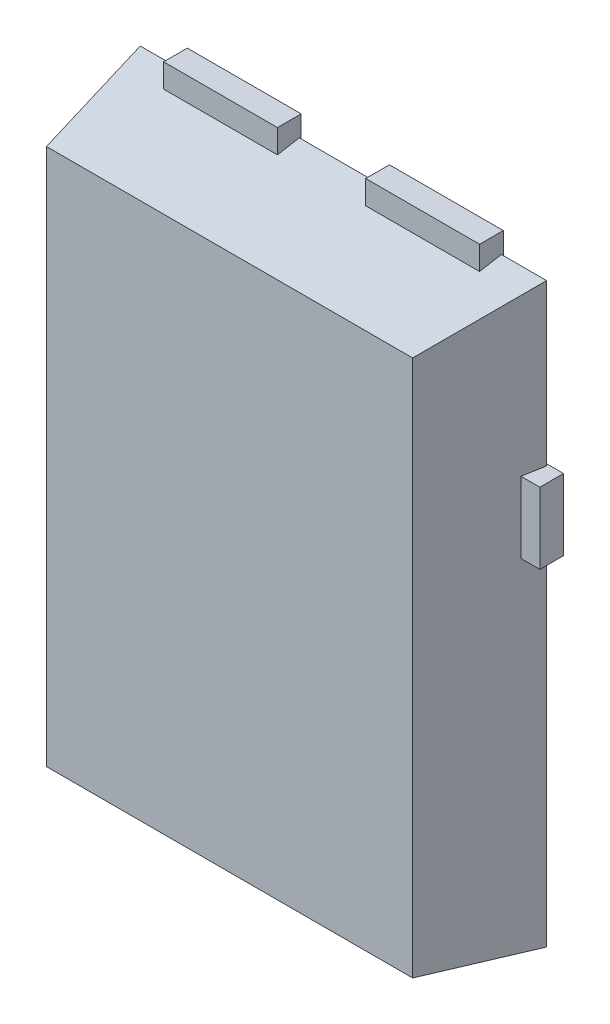
ISO-10303-21;
HEADER;
FILE_DESCRIPTION(('STEP AP214'),'2;1');
FILE_NAME('part.step','',(''),(''),'','','');
FILE_SCHEMA(('AUTOMOTIVE_DESIGN { 1 0 10303 214 1 1 1 1 }'));
ENDSEC;
DATA;
#1=APPLICATION_CONTEXT('core data for automotive mechanical design processes');
#2=APPLICATION_PROTOCOL_DEFINITION('international standard','automotive_design',2000,#1);
#3=PRODUCT_CONTEXT('',#1,'mechanical');
#4=PRODUCT('Part','Part','',(#3));
#5=PRODUCT_RELATED_PRODUCT_CATEGORY('part','',(#4));
#6=PRODUCT_DEFINITION_FORMATION('','',#4);
#7=PRODUCT_DEFINITION_CONTEXT('part definition',#1,'design');
#8=PRODUCT_DEFINITION('design','',#6,#7);
#9=PRODUCT_DEFINITION_SHAPE('','',#8);
#10=(LENGTH_UNIT() NAMED_UNIT(*) SI_UNIT(.MILLI.,.METRE.));
#11=(NAMED_UNIT(*) PLANE_ANGLE_UNIT() SI_UNIT($,.RADIAN.));
#12=(NAMED_UNIT(*) SI_UNIT($,.STERADIAN.) SOLID_ANGLE_UNIT());
#13=UNCERTAINTY_MEASURE_WITH_UNIT(LENGTH_MEASURE(1.E-05),#10,'distance_accuracy_value','');
#14=(GEOMETRIC_REPRESENTATION_CONTEXT(3) GLOBAL_UNCERTAINTY_ASSIGNED_CONTEXT((#13)) GLOBAL_UNIT_ASSIGNED_CONTEXT((#10,
#11,#12)) REPRESENTATION_CONTEXT('',''));
#15=CARTESIAN_POINT('',(0.,0.,0.));
#16=DIRECTION('',(0.,0.,1.));
#17=DIRECTION('',(1.,0.,0.));
#18=AXIS2_PLACEMENT_3D('',#15,#16,#17);
#19=CARTESIAN_POINT('',(0.465,3.25,0.25));
#20=DIRECTION('',(1.,0.,0.));
#21=DIRECTION('',(0.,1.,0.));
#22=AXIS2_PLACEMENT_3D('',#19,#20,#21);
#23=PLANE('',#22);
#24=DIRECTION('',(0.,-1.,0.));
#25=VECTOR('',#24,1.);
#26=CARTESIAN_POINT('',(0.465,3.25,0.));
#27=LINE('',#26,#25);
#28=CARTESIAN_POINT('',(0.465,3.25,0.));
#29=VERTEX_POINT('',#28);
#30=CARTESIAN_POINT('',(0.464999999999999,2.16,0.));
#31=VERTEX_POINT('',#30);
#32=EDGE_CURVE('E109',#29,#31,#27,.T.);
#33=ORIENTED_EDGE('',*,*,#32,.T.);
#34=DIRECTION('',(0.,0.,-1.));
#35=VECTOR('',#34,1.);
#36=CARTESIAN_POINT('',(0.464999999999999,2.16,0.25));
#37=LINE('',#36,#35);
#38=CARTESIAN_POINT('',(0.464999999999999,2.16,0.25));
#39=VERTEX_POINT('',#38);
#40=EDGE_CURVE('E12',#39,#31,#37,.T.);
#41=ORIENTED_EDGE('',*,*,#40,.F.);
#42=DIRECTION('',(0.,-1.,0.));
#43=VECTOR('',#42,1.);
#44=CARTESIAN_POINT('',(0.465,3.25,0.25));
#45=LINE('',#44,#43);
#46=CARTESIAN_POINT('',(0.465,3.25,0.25));
#47=VERTEX_POINT('',#46);
#48=EDGE_CURVE('E97',#47,#39,#45,.T.);
#49=ORIENTED_EDGE('',*,*,#48,.F.);
#50=DIRECTION('',(0.,0.,-1.));
#51=VECTOR('',#50,1.);
#52=CARTESIAN_POINT('',(0.465,3.25,0.25));
#53=LINE('',#52,#51);
#54=EDGE_CURVE('E105',#47,#29,#53,.T.);
#55=ORIENTED_EDGE('',*,*,#54,.T.);
#56=EDGE_LOOP('',(#33,#41,#49,#55));
#57=FACE_BOUND('',#56,.T.);
#58=ADVANCED_FACE('F46',(#57),#23,.F.);
#59=CARTESIAN_POINT('',(0.464999999999999,2.16,0.25));
#60=DIRECTION('',(0.,1.,0.));
#61=DIRECTION('',(-1.,0.,0.));
#62=AXIS2_PLACEMENT_3D('',#59,#60,#61);
#63=PLANE('',#62);
#64=DIRECTION('',(1.,0.,0.));
#65=VECTOR('',#64,1.);
#66=CARTESIAN_POINT('',(0.464999999999999,2.16,0.));
#67=LINE('',#66,#65);
#68=CARTESIAN_POINT('',(1.665,2.16,0.));
#69=VERTEX_POINT('',#68);
#70=EDGE_CURVE('E101',#31,#69,#67,.T.);
#71=ORIENTED_EDGE('',*,*,#70,.T.);
#72=DIRECTION('',(0.,0.,-1.));
#73=VECTOR('',#72,1.);
#74=CARTESIAN_POINT('',(1.665,2.16,0.25));
#75=LINE('',#74,#73);
#76=CARTESIAN_POINT('',(1.665,2.16,0.25));
#77=VERTEX_POINT('',#76);
#78=EDGE_CURVE('E54',#77,#69,#75,.T.);
#79=ORIENTED_EDGE('',*,*,#78,.F.);
#80=DIRECTION('',(1.,0.,0.));
#81=VECTOR('',#80,1.);
#82=CARTESIAN_POINT('',(0.464999999999999,2.16,0.25));
#83=LINE('',#82,#81);
#84=EDGE_CURVE('E92',#39,#77,#83,.T.);
#85=ORIENTED_EDGE('',*,*,#84,.F.);
#86=ORIENTED_EDGE('',*,*,#40,.T.);
#87=EDGE_LOOP('',(#71,#79,#85,#86));
#88=FACE_BOUND('',#87,.T.);
#89=ADVANCED_FACE('F100',(#88),#63,.F.);
#90=CARTESIAN_POINT('',(1.665,3.25,0.25));
#91=DIRECTION('',(-1.,0.,0.));
#92=DIRECTION('',(0.,0.,1.));
#93=AXIS2_PLACEMENT_3D('',#90,#91,#92);
#94=PLANE('',#93);
#95=DIRECTION('',(0.,1.,0.));
#96=VECTOR('',#95,1.);
#97=CARTESIAN_POINT('',(1.665,3.25,0.));
#98=LINE('',#97,#96);
#99=CARTESIAN_POINT('',(1.665,3.25,0.));
#100=VERTEX_POINT('',#99);
#101=EDGE_CURVE('E79',#69,#100,#98,.T.);
#102=ORIENTED_EDGE('',*,*,#101,.T.);
#103=DIRECTION('',(0.,0.,-1.));
#104=VECTOR('',#103,1.);
#105=CARTESIAN_POINT('',(1.665,3.25,0.25));
#106=LINE('',#105,#104);
#107=CARTESIAN_POINT('',(1.665,3.25,0.25));
#108=VERTEX_POINT('',#107);
#109=EDGE_CURVE('E102',#108,#100,#106,.T.);
#110=ORIENTED_EDGE('',*,*,#109,.F.);
#111=DIRECTION('',(0.,1.,0.));
#112=VECTOR('',#111,1.);
#113=CARTESIAN_POINT('',(1.665,3.25,0.25));
#114=LINE('',#113,#112);
#115=EDGE_CURVE('E95',#77,#108,#114,.T.);
#116=ORIENTED_EDGE('',*,*,#115,.F.);
#117=ORIENTED_EDGE('',*,*,#78,.T.);
#118=EDGE_LOOP('',(#102,#110,#116,#117));
#119=FACE_BOUND('',#118,.T.);
#120=ADVANCED_FACE('F103',(#119),#94,.F.);
#121=CARTESIAN_POINT('',(0.465,3.25,0.25));
#122=DIRECTION('',(0.,-1.,0.));
#123=DIRECTION('',(1.,0.,0.));
#124=AXIS2_PLACEMENT_3D('',#121,#122,#123);
#125=PLANE('',#124);
#126=DIRECTION('',(-1.,0.,0.));
#127=VECTOR('',#126,1.);
#128=CARTESIAN_POINT('',(0.465,3.25,0.));
#129=LINE('',#128,#127);
#130=EDGE_CURVE('E85',#100,#29,#129,.T.);
#131=ORIENTED_EDGE('',*,*,#130,.T.);
#132=ORIENTED_EDGE('',*,*,#54,.F.);
#133=DIRECTION('',(-1.,0.,0.));
#134=VECTOR('',#133,1.);
#135=CARTESIAN_POINT('',(0.465,3.25,0.25));
#136=LINE('',#135,#134);
#137=EDGE_CURVE('E62',#108,#47,#136,.T.);
#138=ORIENTED_EDGE('',*,*,#137,.F.);
#139=ORIENTED_EDGE('',*,*,#109,.T.);
#140=EDGE_LOOP('',(#131,#132,#138,#139));
#141=FACE_BOUND('',#140,.T.);
#142=ADVANCED_FACE('F116',(#141),#125,.F.);
#143=CARTESIAN_POINT('',(0.,0.,0.25));
#144=DIRECTION('',(0.,0.,1.));
#145=DIRECTION('',(1.,0.,0.));
#146=AXIS2_PLACEMENT_3D('',#143,#144,#145);
#147=PLANE('',#146);
#148=ORIENTED_EDGE('',*,*,#48,.T.);
#149=ORIENTED_EDGE('',*,*,#84,.T.);
#150=ORIENTED_EDGE('',*,*,#115,.T.);
#151=ORIENTED_EDGE('',*,*,#137,.T.);
#152=EDGE_LOOP('',(#148,#149,#150,#151));
#153=FACE_BOUND('',#152,.T.);
#154=ADVANCED_FACE('F93',(#153),#147,.T.);
#155=CARTESIAN_POINT('',(0.,0.,0.));
#156=DIRECTION('',(0.,0.,1.));
#157=DIRECTION('',(1.,0.,0.));
#158=AXIS2_PLACEMENT_3D('',#155,#156,#157);
#159=PLANE('',#158);
#160=ORIENTED_EDGE('',*,*,#32,.F.);
#161=ORIENTED_EDGE('',*,*,#130,.F.);
#162=ORIENTED_EDGE('',*,*,#101,.F.);
#163=ORIENTED_EDGE('',*,*,#70,.F.);
#164=EDGE_LOOP('',(#160,#161,#162,#163));
#165=FACE_BOUND('',#164,.T.);
#166=ADVANCED_FACE('F119',(#165),#159,.F.);
#167=CLOSED_SHELL('',(#58,#89,#120,#142,#154,#166));
#168=MANIFOLD_SOLID_BREP('B2',#167);
#169=CARTESIAN_POINT('',(-1.665,3.25,0.25));
#170=DIRECTION('',(1.,0.,0.));
#171=DIRECTION('',(0.,0.,-1.));
#172=AXIS2_PLACEMENT_3D('',#169,#170,#171);
#173=PLANE('',#172);
#174=DIRECTION('',(0.,-1.,0.));
#175=VECTOR('',#174,1.);
#176=CARTESIAN_POINT('',(-1.665,3.25,0.));
#177=LINE('',#176,#175);
#178=CARTESIAN_POINT('',(-1.665,3.25,0.));
#179=VERTEX_POINT('',#178);
#180=CARTESIAN_POINT('',(-1.665,2.16,0.));
#181=VERTEX_POINT('',#180);
#182=EDGE_CURVE('E242',#179,#181,#177,.T.);
#183=ORIENTED_EDGE('',*,*,#182,.T.);
#184=DIRECTION('',(0.,0.,-1.));
#185=VECTOR('',#184,1.);
#186=CARTESIAN_POINT('',(-1.665,2.16,0.25));
#187=LINE('',#186,#185);
#188=CARTESIAN_POINT('',(-1.665,2.16,0.25));
#189=VERTEX_POINT('',#188);
#190=EDGE_CURVE('E44',#189,#181,#187,.T.);
#191=ORIENTED_EDGE('',*,*,#190,.F.);
#192=DIRECTION('',(0.,-1.,0.));
#193=VECTOR('',#192,1.);
#194=CARTESIAN_POINT('',(-1.665,3.25,0.25));
#195=LINE('',#194,#193);
#196=CARTESIAN_POINT('',(-1.665,3.25,0.25));
#197=VERTEX_POINT('',#196);
#198=EDGE_CURVE('E230',#197,#189,#195,.T.);
#199=ORIENTED_EDGE('',*,*,#198,.F.);
#200=DIRECTION('',(0.,0.,-1.));
#201=VECTOR('',#200,1.);
#202=CARTESIAN_POINT('',(-1.665,3.25,0.25));
#203=LINE('',#202,#201);
#204=EDGE_CURVE('E238',#197,#179,#203,.T.);
#205=ORIENTED_EDGE('',*,*,#204,.T.);
#206=EDGE_LOOP('',(#183,#191,#199,#205));
#207=FACE_BOUND('',#206,.T.);
#208=ADVANCED_FACE('F179',(#207),#173,.F.);
#209=CARTESIAN_POINT('',(-1.665,2.16,0.25));
#210=DIRECTION('',(0.,1.,0.));
#211=DIRECTION('',(-1.,0.,0.));
#212=AXIS2_PLACEMENT_3D('',#209,#210,#211);
#213=PLANE('',#212);
#214=DIRECTION('',(1.,0.,0.));
#215=VECTOR('',#214,1.);
#216=CARTESIAN_POINT('',(-1.665,2.16,0.));
#217=LINE('',#216,#215);
#218=CARTESIAN_POINT('',(-0.464999999999999,2.16,0.));
#219=VERTEX_POINT('',#218);
#220=EDGE_CURVE('E234',#181,#219,#217,.T.);
#221=ORIENTED_EDGE('',*,*,#220,.T.);
#222=DIRECTION('',(0.,0.,-1.));
#223=VECTOR('',#222,1.);
#224=CARTESIAN_POINT('',(-0.464999999999999,2.16,0.25));
#225=LINE('',#224,#223);
#226=CARTESIAN_POINT('',(-0.464999999999999,2.16,0.25));
#227=VERTEX_POINT('',#226);
#228=EDGE_CURVE('E187',#227,#219,#225,.T.);
#229=ORIENTED_EDGE('',*,*,#228,.F.);
#230=DIRECTION('',(1.,0.,0.));
#231=VECTOR('',#230,1.);
#232=CARTESIAN_POINT('',(-1.665,2.16,0.25));
#233=LINE('',#232,#231);
#234=EDGE_CURVE('E225',#189,#227,#233,.T.);
#235=ORIENTED_EDGE('',*,*,#234,.F.);
#236=ORIENTED_EDGE('',*,*,#190,.T.);
#237=EDGE_LOOP('',(#221,#229,#235,#236));
#238=FACE_BOUND('',#237,.T.);
#239=ADVANCED_FACE('F233',(#238),#213,.F.);
#240=CARTESIAN_POINT('',(-0.465,3.25,0.25));
#241=DIRECTION('',(-1.,0.,0.));
#242=DIRECTION('',(0.,-1.,0.));
#243=AXIS2_PLACEMENT_3D('',#240,#241,#242);
#244=PLANE('',#243);
#245=DIRECTION('',(0.,1.,0.));
#246=VECTOR('',#245,1.);
#247=CARTESIAN_POINT('',(-0.465,3.25,0.));
#248=LINE('',#247,#246);
#249=CARTESIAN_POINT('',(-0.465,3.25,0.));
#250=VERTEX_POINT('',#249);
#251=EDGE_CURVE('E212',#219,#250,#248,.T.);
#252=ORIENTED_EDGE('',*,*,#251,.T.);
#253=DIRECTION('',(0.,0.,-1.));
#254=VECTOR('',#253,1.);
#255=CARTESIAN_POINT('',(-0.465,3.25,0.25));
#256=LINE('',#255,#254);
#257=CARTESIAN_POINT('',(-0.465,3.25,0.25));
#258=VERTEX_POINT('',#257);
#259=EDGE_CURVE('E235',#258,#250,#256,.T.);
#260=ORIENTED_EDGE('',*,*,#259,.F.);
#261=DIRECTION('',(0.,1.,0.));
#262=VECTOR('',#261,1.);
#263=CARTESIAN_POINT('',(-0.465,3.25,0.25));
#264=LINE('',#263,#262);
#265=EDGE_CURVE('E228',#227,#258,#264,.T.);
#266=ORIENTED_EDGE('',*,*,#265,.F.);
#267=ORIENTED_EDGE('',*,*,#228,.T.);
#268=EDGE_LOOP('',(#252,#260,#266,#267));
#269=FACE_BOUND('',#268,.T.);
#270=ADVANCED_FACE('F236',(#269),#244,.F.);
#271=CARTESIAN_POINT('',(-1.665,3.25,0.25));
#272=DIRECTION('',(0.,-1.,0.));
#273=DIRECTION('',(1.,0.,0.));
#274=AXIS2_PLACEMENT_3D('',#271,#272,#273);
#275=PLANE('',#274);
#276=DIRECTION('',(-1.,0.,0.));
#277=VECTOR('',#276,1.);
#278=CARTESIAN_POINT('',(-1.665,3.25,0.));
#279=LINE('',#278,#277);
#280=EDGE_CURVE('E218',#250,#179,#279,.T.);
#281=ORIENTED_EDGE('',*,*,#280,.T.);
#282=ORIENTED_EDGE('',*,*,#204,.F.);
#283=DIRECTION('',(-1.,0.,0.));
#284=VECTOR('',#283,1.);
#285=CARTESIAN_POINT('',(-1.665,3.25,0.25));
#286=LINE('',#285,#284);
#287=EDGE_CURVE('E195',#258,#197,#286,.T.);
#288=ORIENTED_EDGE('',*,*,#287,.F.);
#289=ORIENTED_EDGE('',*,*,#259,.T.);
#290=EDGE_LOOP('',(#281,#282,#288,#289));
#291=FACE_BOUND('',#290,.T.);
#292=ADVANCED_FACE('F249',(#291),#275,.F.);
#293=CARTESIAN_POINT('',(0.,0.,0.25));
#294=DIRECTION('',(0.,0.,1.));
#295=DIRECTION('',(1.,0.,0.));
#296=AXIS2_PLACEMENT_3D('',#293,#294,#295);
#297=PLANE('',#296);
#298=ORIENTED_EDGE('',*,*,#198,.T.);
#299=ORIENTED_EDGE('',*,*,#234,.T.);
#300=ORIENTED_EDGE('',*,*,#265,.T.);
#301=ORIENTED_EDGE('',*,*,#287,.T.);
#302=EDGE_LOOP('',(#298,#299,#300,#301));
#303=FACE_BOUND('',#302,.T.);
#304=ADVANCED_FACE('F226',(#303),#297,.T.);
#305=CARTESIAN_POINT('',(0.,0.,0.));
#306=DIRECTION('',(0.,0.,1.));
#307=DIRECTION('',(1.,0.,0.));
#308=AXIS2_PLACEMENT_3D('',#305,#306,#307);
#309=PLANE('',#308);
#310=ORIENTED_EDGE('',*,*,#182,.F.);
#311=ORIENTED_EDGE('',*,*,#280,.F.);
#312=ORIENTED_EDGE('',*,*,#251,.F.);
#313=ORIENTED_EDGE('',*,*,#220,.F.);
#314=EDGE_LOOP('',(#310,#311,#312,#313));
#315=FACE_BOUND('',#314,.T.);
#316=ADVANCED_FACE('F252',(#315),#309,.F.);
#317=CLOSED_SHELL('',(#208,#239,#270,#292,#304,#316));
#318=MANIFOLD_SOLID_BREP('B6',#317);
#319=CARTESIAN_POINT('',(-1.775,-2.59,0.25));
#320=DIRECTION('',(0.,1.,0.));
#321=DIRECTION('',(0.,0.,1.));
#322=AXIS2_PLACEMENT_3D('',#319,#320,#321);
#323=PLANE('',#322);
#324=DIRECTION('',(1.,0.,0.));
#325=VECTOR('',#324,1.);
#326=CARTESIAN_POINT('',(-1.775,-2.59,0.02));
#327=LINE('',#326,#325);
#328=CARTESIAN_POINT('',(-1.775,-2.59,0.02));
#329=VERTEX_POINT('',#328);
#330=CARTESIAN_POINT('',(-1.025,-2.59,0.02));
#331=VERTEX_POINT('',#330);
#332=EDGE_CURVE('E687',#329,#331,#327,.T.);
#333=ORIENTED_EDGE('',*,*,#332,.F.);
#334=DIRECTION('',(0.,0.,-1.));
#335=VECTOR('',#334,1.);
#336=CARTESIAN_POINT('',(-1.775,-2.59,0.25));
#337=LINE('',#336,#335);
#338=CARTESIAN_POINT('',(-1.775,-2.59,0.));
#339=VERTEX_POINT('',#338);
#340=EDGE_CURVE('E489',#329,#339,#337,.T.);
#341=ORIENTED_EDGE('',*,*,#340,.T.);
#342=DIRECTION('',(1.,0.,0.));
#343=VECTOR('',#342,1.);
#344=CARTESIAN_POINT('',(-1.775,-2.59,0.));
#345=LINE('',#344,#343);
#346=CARTESIAN_POINT('',(-1.025,-2.59,0.));
#347=VERTEX_POINT('',#346);
#348=EDGE_CURVE('E490',#339,#347,#345,.T.);
#349=ORIENTED_EDGE('',*,*,#348,.T.);
#350=DIRECTION('',(0.,0.,-1.));
#351=VECTOR('',#350,1.);
#352=CARTESIAN_POINT('',(-1.025,-2.59,0.25));
#353=LINE('',#352,#351);
#354=EDGE_CURVE('E469',#331,#347,#353,.T.);
#355=ORIENTED_EDGE('',*,*,#354,.F.);
#356=EDGE_LOOP('',(#333,#341,#349,#355));
#357=FACE_BOUND('',#356,.T.);
#358=ADVANCED_FACE('F303',(#357),#323,.F.);
#359=CARTESIAN_POINT('',(-1.025,-2.59,0.25));
#360=DIRECTION('',(1.,0.,0.));
#361=DIRECTION('',(0.,0.,-1.));
#362=AXIS2_PLACEMENT_3D('',#359,#360,#361);
#363=PLANE('',#362);
#364=DIRECTION('',(0.,-1.,0.));
#365=VECTOR('',#364,1.);
#366=CARTESIAN_POINT('',(-1.025,-2.59,0.25));
#367=LINE('',#366,#365);
#368=CARTESIAN_POINT('',(-1.025,-3.00062844540163,0.25));
#369=VERTEX_POINT('',#368);
#370=CARTESIAN_POINT('',(-1.025,-3.25,0.25));
#371=VERTEX_POINT('',#370);
#372=EDGE_CURVE('E450',#369,#371,#367,.T.);
#373=ORIENTED_EDGE('',*,*,#372,.F.);
#374=DIRECTION('',(0.,-0.173648177666937,-0.984807753012207));
#375=VECTOR('',#374,1.);
#376=CARTESIAN_POINT('',(-1.025,-2.98824648271516,0.320221599874933));
#377=LINE('',#376,#375);
#378=CARTESIAN_POINT('',(-1.025,-3.04118365096458,0.02));
#379=VERTEX_POINT('',#378);
#380=EDGE_CURVE('E557',#369,#379,#377,.T.);
#381=ORIENTED_EDGE('',*,*,#380,.T.);
#382=DIRECTION('',(0.,-1.,0.));
#383=VECTOR('',#382,1.);
#384=CARTESIAN_POINT('',(-1.025,-2.59,0.02));
#385=LINE('',#384,#383);
#386=EDGE_CURVE('E618',#331,#379,#385,.T.);
#387=ORIENTED_EDGE('',*,*,#386,.F.);
#388=ORIENTED_EDGE('',*,*,#354,.T.);
#389=DIRECTION('',(0.,-1.,0.));
#390=VECTOR('',#389,1.);
#391=CARTESIAN_POINT('',(-1.025,-2.59,0.));
#392=LINE('',#391,#390);
#393=CARTESIAN_POINT('',(-1.025,-3.25,0.));
#394=VERTEX_POINT('',#393);
#395=EDGE_CURVE('E466',#347,#394,#392,.T.);
#396=ORIENTED_EDGE('',*,*,#395,.T.);
#397=DIRECTION('',(0.,0.,-1.));
#398=VECTOR('',#397,1.);
#399=CARTESIAN_POINT('',(-1.025,-3.25,0.25));
#400=LINE('',#399,#398);
#401=EDGE_CURVE('E463',#371,#394,#400,.T.);
#402=ORIENTED_EDGE('',*,*,#401,.F.);
#403=EDGE_LOOP('',(#373,#381,#387,#388,#396,#402));
#404=FACE_BOUND('',#403,.T.);
#405=ADVANCED_FACE('F464',(#404),#363,.F.);
#406=CARTESIAN_POINT('',(1.025,-3.25,0.25));
#407=DIRECTION('',(-1.,0.,0.));
#408=DIRECTION('',(0.,0.,1.));
#409=AXIS2_PLACEMENT_3D('',#406,#407,#408);
#410=PLANE('',#409);
#411=DIRECTION('',(0.,1.,0.));
#412=VECTOR('',#411,1.);
#413=CARTESIAN_POINT('',(1.025,-3.25,0.02));
#414=LINE('',#413,#412);
#415=CARTESIAN_POINT('',(1.025,-3.04118365096458,0.02));
#416=VERTEX_POINT('',#415);
#417=CARTESIAN_POINT('',(1.025,-2.59,0.02));
#418=VERTEX_POINT('',#417);
#419=EDGE_CURVE('E493',#416,#418,#414,.T.);
#420=ORIENTED_EDGE('',*,*,#419,.F.);
#421=DIRECTION('',(0.,0.173648177666937,0.984807753012207));
#422=VECTOR('',#421,1.);
#423=CARTESIAN_POINT('',(1.025,-3.00814791785581,0.207354952577458));
#424=LINE('',#423,#422);
#425=CARTESIAN_POINT('',(1.025,-3.00062844540163,0.25));
#426=VERTEX_POINT('',#425);
#427=EDGE_CURVE('E553',#416,#426,#424,.T.);
#428=ORIENTED_EDGE('',*,*,#427,.T.);
#429=DIRECTION('',(0.,1.,0.));
#430=VECTOR('',#429,1.);
#431=CARTESIAN_POINT('',(1.025,-3.25,0.25));
#432=LINE('',#431,#430);
#433=CARTESIAN_POINT('',(1.025,-3.25,0.25));
#434=VERTEX_POINT('',#433);
#435=EDGE_CURVE('E475',#434,#426,#432,.T.);
#436=ORIENTED_EDGE('',*,*,#435,.F.);
#437=DIRECTION('',(0.,0.,-1.));
#438=VECTOR('',#437,1.);
#439=CARTESIAN_POINT('',(1.025,-3.25,0.25));
#440=LINE('',#439,#438);
#441=CARTESIAN_POINT('',(1.025,-3.25,0.));
#442=VERTEX_POINT('',#441);
#443=EDGE_CURVE('E470',#434,#442,#440,.T.);
#444=ORIENTED_EDGE('',*,*,#443,.T.);
#445=DIRECTION('',(0.,1.,0.));
#446=VECTOR('',#445,1.);
#447=CARTESIAN_POINT('',(1.025,-3.25,0.));
#448=LINE('',#447,#446);
#449=CARTESIAN_POINT('',(1.025,-2.59,0.));
#450=VERTEX_POINT('',#449);
#451=EDGE_CURVE('E497',#442,#450,#448,.T.);
#452=ORIENTED_EDGE('',*,*,#451,.T.);
#453=DIRECTION('',(0.,0.,-1.));
#454=VECTOR('',#453,1.);
#455=CARTESIAN_POINT('',(1.025,-2.59,0.25));
#456=LINE('',#455,#454);
#457=EDGE_CURVE('E538',#418,#450,#456,.T.);
#458=ORIENTED_EDGE('',*,*,#457,.F.);
#459=EDGE_LOOP('',(#420,#428,#436,#444,#452,#458));
#460=FACE_BOUND('',#459,.T.);
#461=ADVANCED_FACE('F630',(#460),#410,.F.);
#462=CARTESIAN_POINT('',(1.025,-2.59,0.25));
#463=DIRECTION('',(0.,1.,0.));
#464=DIRECTION('',(0.,0.,1.));
#465=AXIS2_PLACEMENT_3D('',#462,#463,#464);
#466=PLANE('',#465);
#467=DIRECTION('',(1.,0.,0.));
#468=VECTOR('',#467,1.);
#469=CARTESIAN_POINT('',(1.025,-2.59,0.02));
#470=LINE('',#469,#468);
#471=CARTESIAN_POINT('',(1.775,-2.59,0.02));
#472=VERTEX_POINT('',#471);
#473=EDGE_CURVE('E615',#418,#472,#470,.T.);
#474=ORIENTED_EDGE('',*,*,#473,.F.);
#475=ORIENTED_EDGE('',*,*,#457,.T.);
#476=DIRECTION('',(1.,0.,0.));
#477=VECTOR('',#476,1.);
#478=CARTESIAN_POINT('',(1.025,-2.59,0.));
#479=LINE('',#478,#477);
#480=CARTESIAN_POINT('',(1.775,-2.59,0.));
#481=VERTEX_POINT('',#480);
#482=EDGE_CURVE('E500',#450,#481,#479,.T.);
#483=ORIENTED_EDGE('',*,*,#482,.T.);
#484=DIRECTION('',(0.,0.,-1.));
#485=VECTOR('',#484,1.);
#486=CARTESIAN_POINT('',(1.775,-2.59,0.25));
#487=LINE('',#486,#485);
#488=EDGE_CURVE('E536',#472,#481,#487,.T.);
#489=ORIENTED_EDGE('',*,*,#488,.F.);
#490=EDGE_LOOP('',(#474,#475,#483,#489));
#491=FACE_BOUND('',#490,.T.);
#492=ADVANCED_FACE('F629',(#491),#466,.F.);
#493=CARTESIAN_POINT('',(1.775,-2.59,0.25));
#494=DIRECTION('',(-1.,0.,0.));
#495=DIRECTION('',(0.,0.,1.));
#496=AXIS2_PLACEMENT_3D('',#493,#494,#495);
#497=PLANE('',#496);
#498=DIRECTION('',(0.,1.,0.));
#499=VECTOR('',#498,1.);
#500=CARTESIAN_POINT('',(1.775,-2.59,0.02));
#501=LINE('',#500,#499);
#502=CARTESIAN_POINT('',(1.775,0.6,0.02));
#503=VERTEX_POINT('',#502);
#504=EDGE_CURVE('E612',#472,#503,#501,.T.);
#505=ORIENTED_EDGE('',*,*,#504,.F.);
#506=ORIENTED_EDGE('',*,*,#488,.T.);
#507=DIRECTION('',(0.,1.,0.));
#508=VECTOR('',#507,1.);
#509=CARTESIAN_POINT('',(1.775,-2.59,0.));
#510=LINE('',#509,#508);
#511=CARTESIAN_POINT('',(1.775,0.6,0.));
#512=VERTEX_POINT('',#511);
#513=EDGE_CURVE('E503',#481,#512,#510,.T.);
#514=ORIENTED_EDGE('',*,*,#513,.T.);
#515=DIRECTION('',(0.,0.,-1.));
#516=VECTOR('',#515,1.);
#517=CARTESIAN_POINT('',(1.775,0.6,0.25));
#518=LINE('',#517,#516);
#519=EDGE_CURVE('E534',#503,#512,#518,.T.);
#520=ORIENTED_EDGE('',*,*,#519,.F.);
#521=EDGE_LOOP('',(#505,#506,#514,#520));
#522=FACE_BOUND('',#521,.T.);
#523=ADVANCED_FACE('F640',(#522),#497,.F.);
#524=CARTESIAN_POINT('',(1.775,0.6,0.25));
#525=DIRECTION('',(0.,1.,0.));
#526=DIRECTION('',(0.,0.,1.));
#527=AXIS2_PLACEMENT_3D('',#524,#525,#526);
#528=PLANE('',#527);
#529=DIRECTION('',(1.,0.,0.));
#530=VECTOR('',#529,1.);
#531=CARTESIAN_POINT('',(1.775,0.6,0.25));
#532=LINE('',#531,#530);
#533=CARTESIAN_POINT('',(2.10062844540163,0.6,0.25));
#534=VERTEX_POINT('',#533);
#535=CARTESIAN_POINT('',(2.3,0.6,0.25));
#536=VERTEX_POINT('',#535);
#537=EDGE_CURVE('E317',#534,#536,#532,.T.);
#538=ORIENTED_EDGE('',*,*,#537,.F.);
#539=DIRECTION('',(0.173648177666937,0.,-0.984807753012207));
#540=VECTOR('',#539,1.);
#541=CARTESIAN_POINT('',(2.09080954633176,0.6,0.305685743783592));
#542=LINE('',#541,#540);
#543=CARTESIAN_POINT('',(2.14118365096458,0.6,0.02));
#544=VERTEX_POINT('',#543);
#545=EDGE_CURVE('E177',#534,#544,#542,.T.);
#546=ORIENTED_EDGE('',*,*,#545,.T.);
#547=DIRECTION('',(1.,0.,0.));
#548=VECTOR('',#547,1.);
#549=CARTESIAN_POINT('',(1.775,0.6,0.02));
#550=LINE('',#549,#548);
#551=EDGE_CURVE('E605',#503,#544,#550,.T.);
#552=ORIENTED_EDGE('',*,*,#551,.F.);
#553=ORIENTED_EDGE('',*,*,#519,.T.);
#554=DIRECTION('',(1.,0.,0.));
#555=VECTOR('',#554,1.);
#556=CARTESIAN_POINT('',(1.775,0.6,0.));
#557=LINE('',#556,#555);
#558=CARTESIAN_POINT('',(2.3,0.6,0.));
#559=VERTEX_POINT('',#558);
#560=EDGE_CURVE('E506',#512,#559,#557,.T.);
#561=ORIENTED_EDGE('',*,*,#560,.T.);
#562=DIRECTION('',(0.,0.,-1.));
#563=VECTOR('',#562,1.);
#564=CARTESIAN_POINT('',(2.3,0.6,0.25));
#565=LINE('',#564,#563);
#566=EDGE_CURVE('E531',#536,#559,#565,.T.);
#567=ORIENTED_EDGE('',*,*,#566,.F.);
#568=EDGE_LOOP('',(#538,#546,#552,#553,#561,#567));
#569=FACE_BOUND('',#568,.T.);
#570=ADVANCED_FACE('F604',(#569),#528,.F.);
#571=CARTESIAN_POINT('',(-2.3,1.35,0.25));
#572=DIRECTION('',(0.,-1.,0.));
#573=DIRECTION('',(0.,0.,-1.));
#574=AXIS2_PLACEMENT_3D('',#571,#572,#573);
#575=PLANE('',#574);
#576=DIRECTION('',(-1.,0.,0.));
#577=VECTOR('',#576,1.);
#578=CARTESIAN_POINT('',(-2.3,1.35,0.25));
#579=LINE('',#578,#577);
#580=CARTESIAN_POINT('',(-2.10062844540163,1.35,0.25));
#581=VERTEX_POINT('',#580);
#582=CARTESIAN_POINT('',(-2.3,1.35,0.25));
#583=VERTEX_POINT('',#582);
#584=EDGE_CURVE('E483',#581,#583,#579,.T.);
#585=ORIENTED_EDGE('',*,*,#584,.F.);
#586=DIRECTION('',(-0.173648177666937,0.,-0.984807753012207));
#587=VECTOR('',#586,1.);
#588=CARTESIAN_POINT('',(-2.10664023337546,1.35,0.2159054561606));
#589=LINE('',#588,#587);
#590=CARTESIAN_POINT('',(-2.14118365096458,1.35,0.02));
#591=VERTEX_POINT('',#590);
#592=EDGE_CURVE('E593',#581,#591,#589,.T.);
#593=ORIENTED_EDGE('',*,*,#592,.T.);
#594=DIRECTION('',(-1.,0.,0.));
#595=VECTOR('',#594,1.);
#596=CARTESIAN_POINT('',(-2.3,1.35,0.02));
#597=LINE('',#596,#595);
#598=CARTESIAN_POINT('',(2.14118365096458,1.35,0.02));
#599=VERTEX_POINT('',#598);
#600=EDGE_CURVE('E613',#599,#591,#597,.T.);
#601=ORIENTED_EDGE('',*,*,#600,.F.);
#602=DIRECTION('',(-0.173648177666937,0.,0.984807753012207));
#603=VECTOR('',#602,1.);
#604=CARTESIAN_POINT('',(1.96793326118304,1.35,1.00255178580967));
#605=LINE('',#604,#603);
#606=CARTESIAN_POINT('',(2.10062844540163,1.35,0.25));
#607=VERTEX_POINT('',#606);
#608=EDGE_CURVE('E595',#599,#607,#605,.T.);
#609=ORIENTED_EDGE('',*,*,#608,.T.);
#610=CARTESIAN_POINT('',(2.3,1.35,0.25));
#611=VERTEX_POINT('',#610);
#612=EDGE_CURVE('E324',#611,#607,#579,.T.);
#613=ORIENTED_EDGE('',*,*,#612,.F.);
#614=DIRECTION('',(0.,0.,-1.));
#615=VECTOR('',#614,1.);
#616=CARTESIAN_POINT('',(2.3,1.35,0.25));
#617=LINE('',#616,#615);
#618=CARTESIAN_POINT('',(2.3,1.35,0.));
#619=VERTEX_POINT('',#618);
#620=EDGE_CURVE('E528',#611,#619,#617,.T.);
#621=ORIENTED_EDGE('',*,*,#620,.T.);
#622=DIRECTION('',(-1.,0.,0.));
#623=VECTOR('',#622,1.);
#624=CARTESIAN_POINT('',(-2.3,1.35,0.));
#625=LINE('',#624,#623);
#626=CARTESIAN_POINT('',(-2.3,1.35,0.));
#627=VERTEX_POINT('',#626);
#628=EDGE_CURVE('E510',#619,#627,#625,.T.);
#629=ORIENTED_EDGE('',*,*,#628,.T.);
#630=DIRECTION('',(0.,0.,-1.));
#631=VECTOR('',#630,1.);
#632=CARTESIAN_POINT('',(-2.3,1.35,0.25));
#633=LINE('',#632,#631);
#634=EDGE_CURVE('E525',#583,#627,#633,.T.);
#635=ORIENTED_EDGE('',*,*,#634,.F.);
#636=EDGE_LOOP('',(#585,#593,#601,#609,#613,#621,#629,#635));
#637=FACE_BOUND('',#636,.T.);
#638=ADVANCED_FACE('F650',(#637),#575,.F.);
#639=CARTESIAN_POINT('',(-1.775,0.6,0.25));
#640=DIRECTION('',(0.,1.,0.));
#641=DIRECTION('',(-1.,0.,0.));
#642=AXIS2_PLACEMENT_3D('',#639,#640,#641);
#643=PLANE('',#642);
#644=DIRECTION('',(1.,0.,0.));
#645=VECTOR('',#644,1.);
#646=CARTESIAN_POINT('',(-1.775,0.6,0.02));
#647=LINE('',#646,#645);
#648=CARTESIAN_POINT('',(-2.14118365096458,0.6,0.02));
#649=VERTEX_POINT('',#648);
#650=CARTESIAN_POINT('',(-1.775,0.6,0.02));
#651=VERTEX_POINT('',#650);
#652=EDGE_CURVE('E688',#649,#651,#647,.T.);
#653=ORIENTED_EDGE('',*,*,#652,.F.);
#654=DIRECTION('',(0.173648177666937,0.,0.984807753012207));
#655=VECTOR('',#654,1.);
#656=CARTESIAN_POINT('',(-2.09080954633176,0.6,0.305685743783592));
#657=LINE('',#656,#655);
#658=CARTESIAN_POINT('',(-2.10062844540163,0.6,0.25));
#659=VERTEX_POINT('',#658);
#660=EDGE_CURVE('E587',#649,#659,#657,.T.);
#661=ORIENTED_EDGE('',*,*,#660,.T.);
#662=DIRECTION('',(1.,0.,0.));
#663=VECTOR('',#662,1.);
#664=CARTESIAN_POINT('',(-1.775,0.6,0.25));
#665=LINE('',#664,#663);
#666=CARTESIAN_POINT('',(-2.3,0.6,0.25));
#667=VERTEX_POINT('',#666);
#668=EDGE_CURVE('E487',#667,#659,#665,.T.);
#669=ORIENTED_EDGE('',*,*,#668,.F.);
#670=DIRECTION('',(0.,0.,-1.));
#671=VECTOR('',#670,1.);
#672=CARTESIAN_POINT('',(-2.3,0.6,0.25));
#673=LINE('',#672,#671);
#674=CARTESIAN_POINT('',(-2.3,0.6,0.));
#675=VERTEX_POINT('',#674);
#676=EDGE_CURVE('E522',#667,#675,#673,.T.);
#677=ORIENTED_EDGE('',*,*,#676,.T.);
#678=DIRECTION('',(1.,0.,0.));
#679=VECTOR('',#678,1.);
#680=CARTESIAN_POINT('',(-1.775,0.6,0.));
#681=LINE('',#680,#679);
#682=CARTESIAN_POINT('',(-1.775,0.6,0.));
#683=VERTEX_POINT('',#682);
#684=EDGE_CURVE('E514',#675,#683,#681,.T.);
#685=ORIENTED_EDGE('',*,*,#684,.T.);
#686=DIRECTION('',(0.,0.,-1.));
#687=VECTOR('',#686,1.);
#688=CARTESIAN_POINT('',(-1.775,0.6,0.25));
#689=LINE('',#688,#687);
#690=EDGE_CURVE('E520',#651,#683,#689,.T.);
#691=ORIENTED_EDGE('',*,*,#690,.F.);
#692=EDGE_LOOP('',(#653,#661,#669,#677,#685,#691));
#693=FACE_BOUND('',#692,.T.);
#694=ADVANCED_FACE('F698',(#693),#643,.F.);
#695=CARTESIAN_POINT('',(-1.775,0.6,0.25));
#696=DIRECTION('',(1.,0.,0.));
#697=DIRECTION('',(0.,0.,-1.));
#698=AXIS2_PLACEMENT_3D('',#695,#696,#697);
#699=PLANE('',#698);
#700=DIRECTION('',(0.,-1.,0.));
#701=VECTOR('',#700,1.);
#702=CARTESIAN_POINT('',(-1.775,0.6,0.02));
#703=LINE('',#702,#701);
#704=EDGE_CURVE('E542',#651,#329,#703,.T.);
#705=ORIENTED_EDGE('',*,*,#704,.F.);
#706=ORIENTED_EDGE('',*,*,#690,.T.);
#707=DIRECTION('',(0.,-1.,0.));
#708=VECTOR('',#707,1.);
#709=CARTESIAN_POINT('',(-1.775,0.6,0.));
#710=LINE('',#709,#708);
#711=EDGE_CURVE('E460',#683,#339,#710,.T.);
#712=ORIENTED_EDGE('',*,*,#711,.T.);
#713=ORIENTED_EDGE('',*,*,#340,.F.);
#714=EDGE_LOOP('',(#705,#706,#712,#713));
#715=FACE_BOUND('',#714,.T.);
#716=ADVANCED_FACE('F697',(#715),#699,.F.);
#717=CARTESIAN_POINT('',(0.,0.,0.25));
#718=DIRECTION('',(0.,0.,-1.));
#719=DIRECTION('',(-1.,0.,0.));
#720=AXIS2_PLACEMENT_3D('',#717,#718,#719);
#721=PLANE('',#720);
#722=ORIENTED_EDGE('',*,*,#668,.T.);
#723=DIRECTION('',(0.,1.,0.));
#724=VECTOR('',#723,1.);
#725=CARTESIAN_POINT('',(-2.10062844540163,0.,0.25));
#726=LINE('',#725,#724);
#727=EDGE_CURVE('E590',#659,#581,#726,.T.);
#728=ORIENTED_EDGE('',*,*,#727,.T.);
#729=ORIENTED_EDGE('',*,*,#584,.T.);
#730=DIRECTION('',(0.,-1.,0.));
#731=VECTOR('',#730,1.);
#732=CARTESIAN_POINT('',(-2.3,1.35,0.25));
#733=LINE('',#732,#731);
#734=EDGE_CURVE('E485',#583,#667,#733,.T.);
#735=ORIENTED_EDGE('',*,*,#734,.T.);
#736=EDGE_LOOP('',(#722,#728,#729,#735));
#737=FACE_BOUND('',#736,.T.);
#738=ADVANCED_FACE('F657',(#737),#721,.F.);
#739=ORIENTED_EDGE('',*,*,#435,.T.);
#740=DIRECTION('',(-1.,0.,0.));
#741=VECTOR('',#740,1.);
#742=CARTESIAN_POINT('',(0.,-3.00062844540163,0.25));
#743=LINE('',#742,#741);
#744=EDGE_CURVE('E457',#426,#369,#743,.T.);
#745=ORIENTED_EDGE('',*,*,#744,.T.);
#746=ORIENTED_EDGE('',*,*,#372,.T.);
#747=DIRECTION('',(1.,0.,0.));
#748=VECTOR('',#747,1.);
#749=CARTESIAN_POINT('',(-1.025,-3.25,0.25));
#750=LINE('',#749,#748);
#751=EDGE_CURVE('E454',#371,#434,#750,.T.);
#752=ORIENTED_EDGE('',*,*,#751,.T.);
#753=EDGE_LOOP('',(#739,#745,#746,#752));
#754=FACE_BOUND('',#753,.T.);
#755=ADVANCED_FACE('F452',(#754),#721,.F.);
#756=ORIENTED_EDGE('',*,*,#612,.T.);
#757=DIRECTION('',(0.,-1.,0.));
#758=VECTOR('',#757,1.);
#759=CARTESIAN_POINT('',(2.10062844540163,0.,0.25));
#760=LINE('',#759,#758);
#761=EDGE_CURVE('E311',#607,#534,#760,.T.);
#762=ORIENTED_EDGE('',*,*,#761,.T.);
#763=ORIENTED_EDGE('',*,*,#537,.T.);
#764=DIRECTION('',(0.,1.,0.));
#765=VECTOR('',#764,1.);
#766=CARTESIAN_POINT('',(2.3,1.35,0.25));
#767=LINE('',#766,#765);
#768=EDGE_CURVE('E481',#536,#611,#767,.T.);
#769=ORIENTED_EDGE('',*,*,#768,.T.);
#770=EDGE_LOOP('',(#756,#762,#763,#769));
#771=FACE_BOUND('',#770,.T.);
#772=ADVANCED_FACE('F598',(#771),#721,.F.);
#773=CARTESIAN_POINT('',(-1.025,-3.25,0.25));
#774=DIRECTION('',(0.,1.,0.));
#775=DIRECTION('',(0.,0.,1.));
#776=AXIS2_PLACEMENT_3D('',#773,#774,#775);
#777=PLANE('',#776);
#778=DIRECTION('',(1.,0.,0.));
#779=VECTOR('',#778,1.);
#780=CARTESIAN_POINT('',(-1.025,-3.25,0.));
#781=LINE('',#780,#779);
#782=EDGE_CURVE('E495',#394,#442,#781,.T.);
#783=ORIENTED_EDGE('',*,*,#782,.T.);
#784=ORIENTED_EDGE('',*,*,#443,.F.);
#785=ORIENTED_EDGE('',*,*,#751,.F.);
#786=ORIENTED_EDGE('',*,*,#401,.T.);
#787=EDGE_LOOP('',(#783,#784,#785,#786));
#788=FACE_BOUND('',#787,.T.);
#789=ADVANCED_FACE('F472',(#788),#777,.F.);
#790=CARTESIAN_POINT('',(2.3,1.35,0.25));
#791=DIRECTION('',(-1.,0.,0.));
#792=DIRECTION('',(0.,0.,1.));
#793=AXIS2_PLACEMENT_3D('',#790,#791,#792);
#794=PLANE('',#793);
#795=DIRECTION('',(0.,1.,0.));
#796=VECTOR('',#795,1.);
#797=CARTESIAN_POINT('',(2.3,1.35,0.));
#798=LINE('',#797,#796);
#799=EDGE_CURVE('E508',#559,#619,#798,.T.);
#800=ORIENTED_EDGE('',*,*,#799,.T.);
#801=ORIENTED_EDGE('',*,*,#620,.F.);
#802=ORIENTED_EDGE('',*,*,#768,.F.);
#803=ORIENTED_EDGE('',*,*,#566,.T.);
#804=EDGE_LOOP('',(#800,#801,#802,#803));
#805=FACE_BOUND('',#804,.T.);
#806=ADVANCED_FACE('F643',(#805),#794,.F.);
#807=CARTESIAN_POINT('',(-2.3,1.35,0.25));
#808=DIRECTION('',(1.,0.,0.));
#809=DIRECTION('',(0.,0.,-1.));
#810=AXIS2_PLACEMENT_3D('',#807,#808,#809);
#811=PLANE('',#810);
#812=DIRECTION('',(0.,-1.,0.));
#813=VECTOR('',#812,1.);
#814=CARTESIAN_POINT('',(-2.3,1.35,0.));
#815=LINE('',#814,#813);
#816=EDGE_CURVE('E512',#627,#675,#815,.T.);
#817=ORIENTED_EDGE('',*,*,#816,.T.);
#818=ORIENTED_EDGE('',*,*,#676,.F.);
#819=ORIENTED_EDGE('',*,*,#734,.F.);
#820=ORIENTED_EDGE('',*,*,#634,.T.);
#821=EDGE_LOOP('',(#817,#818,#819,#820));
#822=FACE_BOUND('',#821,.T.);
#823=ADVANCED_FACE('F653',(#822),#811,.F.);
#824=CARTESIAN_POINT('',(0.,0.,0.));
#825=DIRECTION('',(0.,0.,-1.));
#826=DIRECTION('',(-1.,0.,0.));
#827=AXIS2_PLACEMENT_3D('',#824,#825,#826);
#828=PLANE('',#827);
#829=ORIENTED_EDGE('',*,*,#348,.F.);
#830=ORIENTED_EDGE('',*,*,#711,.F.);
#831=ORIENTED_EDGE('',*,*,#684,.F.);
#832=ORIENTED_EDGE('',*,*,#816,.F.);
#833=ORIENTED_EDGE('',*,*,#628,.F.);
#834=ORIENTED_EDGE('',*,*,#799,.F.);
#835=ORIENTED_EDGE('',*,*,#560,.F.);
#836=ORIENTED_EDGE('',*,*,#513,.F.);
#837=ORIENTED_EDGE('',*,*,#482,.F.);
#838=ORIENTED_EDGE('',*,*,#451,.F.);
#839=ORIENTED_EDGE('',*,*,#782,.F.);
#840=ORIENTED_EDGE('',*,*,#395,.F.);
#841=EDGE_LOOP('',(#829,#830,#831,#832,#833,#834,#835,#836,#837,#838,#839,#840));
#842=FACE_BOUND('',#841,.T.);
#843=ADVANCED_FACE('F636',(#842),#828,.T.);
#844=CARTESIAN_POINT('',(0.,0.,0.02));
#845=DIRECTION('',(0.,0.,1.));
#846=DIRECTION('',(1.,0.,0.));
#847=AXIS2_PLACEMENT_3D('',#844,#845,#846);
#848=PLANE('',#847);
#849=ORIENTED_EDGE('',*,*,#551,.T.);
#850=DIRECTION('',(0.,-1.,0.));
#851=VECTOR('',#850,1.);
#852=CARTESIAN_POINT('',(2.14118365096458,0.,0.0200000000000001));
#853=LINE('',#852,#851);
#854=CARTESIAN_POINT('',(2.14118365096458,-3.04118365096458,0.0200000000000001));
#855=VERTEX_POINT('',#854);
#856=EDGE_CURVE('E585',#544,#855,#853,.T.);
#857=ORIENTED_EDGE('',*,*,#856,.T.);
#858=DIRECTION('',(-1.,0.,0.));
#859=VECTOR('',#858,1.);
#860=CARTESIAN_POINT('',(0.,-3.04118365096458,0.0200000000000001));
#861=LINE('',#860,#859);
#862=EDGE_CURVE('E548',#855,#416,#861,.T.);
#863=ORIENTED_EDGE('',*,*,#862,.T.);
#864=ORIENTED_EDGE('',*,*,#419,.T.);
#865=ORIENTED_EDGE('',*,*,#473,.T.);
#866=ORIENTED_EDGE('',*,*,#504,.T.);
#867=EDGE_LOOP('',(#849,#857,#863,#864,#865,#866));
#868=FACE_BOUND('',#867,.T.);
#869=ADVANCED_FACE('F609',(#868),#848,.F.);
#870=ORIENTED_EDGE('',*,*,#600,.T.);
#871=DIRECTION('',(0.,1.,0.));
#872=VECTOR('',#871,1.);
#873=CARTESIAN_POINT('',(-2.14118365096458,0.,0.0200000000000001));
#874=LINE('',#873,#872);
#875=CARTESIAN_POINT('',(-2.14118365096458,3.04118365096458,0.0200000000000001));
#876=VERTEX_POINT('',#875);
#877=EDGE_CURVE('E579',#591,#876,#874,.T.);
#878=ORIENTED_EDGE('',*,*,#877,.T.);
#879=DIRECTION('',(1.,0.,0.));
#880=VECTOR('',#879,1.);
#881=CARTESIAN_POINT('',(0.,3.04118365096458,0.0200000000000001));
#882=LINE('',#881,#880);
#883=CARTESIAN_POINT('',(2.14118365096458,3.04118365096458,0.0200000000000001));
#884=VERTEX_POINT('',#883);
#885=EDGE_CURVE('E562',#876,#884,#882,.T.);
#886=ORIENTED_EDGE('',*,*,#885,.T.);
#887=DIRECTION('',(0.,-1.,0.));
#888=VECTOR('',#887,1.);
#889=CARTESIAN_POINT('',(2.14118365096458,0.,0.0200000000000001));
#890=LINE('',#889,#888);
#891=EDGE_CURVE('E577',#884,#599,#890,.T.);
#892=ORIENTED_EDGE('',*,*,#891,.T.);
#893=EDGE_LOOP('',(#870,#878,#886,#892));
#894=FACE_BOUND('',#893,.T.);
#895=ADVANCED_FACE('F664',(#894),#848,.F.);
#896=DIRECTION('',(-1.,0.,0.));
#897=VECTOR('',#896,1.);
#898=CARTESIAN_POINT('',(0.,-3.04118365096458,0.0200000000000001));
#899=LINE('',#898,#897);
#900=CARTESIAN_POINT('',(-2.14118365096458,-3.04118365096458,0.0200000000000001));
#901=VERTEX_POINT('',#900);
#902=EDGE_CURVE('E550',#379,#901,#899,.T.);
#903=ORIENTED_EDGE('',*,*,#902,.T.);
#904=DIRECTION('',(0.,1.,0.));
#905=VECTOR('',#904,1.);
#906=CARTESIAN_POINT('',(-2.14118365096458,0.,0.0200000000000001));
#907=LINE('',#906,#905);
#908=EDGE_CURVE('E575',#901,#649,#907,.T.);
#909=ORIENTED_EDGE('',*,*,#908,.T.);
#910=ORIENTED_EDGE('',*,*,#652,.T.);
#911=ORIENTED_EDGE('',*,*,#704,.T.);
#912=ORIENTED_EDGE('',*,*,#332,.T.);
#913=ORIENTED_EDGE('',*,*,#386,.T.);
#914=EDGE_LOOP('',(#903,#909,#910,#911,#912,#913));
#915=FACE_BOUND('',#914,.T.);
#916=ADVANCED_FACE('F685',(#915),#848,.F.);
#917=CARTESIAN_POINT('',(0.,0.,1.22));
#918=DIRECTION('',(0.,0.,1.));
#919=DIRECTION('',(1.,0.,0.));
#920=AXIS2_PLACEMENT_3D('',#917,#918,#919);
#921=PLANE('',#920);
#922=DIRECTION('',(-1.,0.,0.));
#923=VECTOR('',#922,1.);
#924=CARTESIAN_POINT('',(-2.15,2.82959127411441,1.22));
#925=LINE('',#924,#923);
#926=CARTESIAN_POINT('',(1.92959127411441,2.82959127411441,1.22));
#927=VERTEX_POINT('',#926);
#928=CARTESIAN_POINT('',(-1.92959127411441,2.82959127411441,1.22));
#929=VERTEX_POINT('',#928);
#930=EDGE_CURVE('E559',#927,#929,#925,.T.);
#931=ORIENTED_EDGE('',*,*,#930,.T.);
#932=DIRECTION('',(0.,-1.,0.));
#933=VECTOR('',#932,1.);
#934=CARTESIAN_POINT('',(-1.92959127411441,-2.82959127411441,1.22));
#935=LINE('',#934,#933);
#936=CARTESIAN_POINT('',(-1.92959127411441,-2.82959127411441,1.22));
#937=VERTEX_POINT('',#936);
#938=EDGE_CURVE('E568',#929,#937,#935,.T.);
#939=ORIENTED_EDGE('',*,*,#938,.T.);
#940=DIRECTION('',(1.,0.,0.));
#941=VECTOR('',#940,1.);
#942=CARTESIAN_POINT('',(2.15,-2.82959127411441,1.22));
#943=LINE('',#942,#941);
#944=CARTESIAN_POINT('',(1.92959127411441,-2.82959127411441,1.22));
#945=VERTEX_POINT('',#944);
#946=EDGE_CURVE('E545',#937,#945,#943,.T.);
#947=ORIENTED_EDGE('',*,*,#946,.T.);
#948=DIRECTION('',(0.,1.,0.));
#949=VECTOR('',#948,1.);
#950=CARTESIAN_POINT('',(1.92959127411441,2.82959127411441,1.22));
#951=LINE('',#950,#949);
#952=EDGE_CURVE('E565',#945,#927,#951,.T.);
#953=ORIENTED_EDGE('',*,*,#952,.T.);
#954=EDGE_LOOP('',(#931,#939,#947,#953));
#955=FACE_BOUND('',#954,.T.);
#956=ADVANCED_FACE('F675',(#955),#921,.T.);
#957=CARTESIAN_POINT('',(0.,-2.82959127411441,1.22));
#958=DIRECTION('',(0.,-0.984807753012207,0.173648177666937));
#959=DIRECTION('',(-1.,0.,0.));
#960=AXIS2_PLACEMENT_3D('',#957,#958,#959);
#961=PLANE('',#960);
#962=ORIENTED_EDGE('',*,*,#946,.F.);
#963=DIRECTION('',(-0.171087869746042,-0.171087869746042,-0.970287525247812));
#964=VECTOR('',#963,1.);
#965=CARTESIAN_POINT('',(-1.87311009374771,-2.77311009374771,1.54032069136419));
#966=LINE('',#965,#964);
#967=EDGE_CURVE('E573',#937,#901,#966,.T.);
#968=ORIENTED_EDGE('',*,*,#967,.T.);
#969=ORIENTED_EDGE('',*,*,#902,.F.);
#970=ORIENTED_EDGE('',*,*,#380,.F.);
#971=ORIENTED_EDGE('',*,*,#744,.F.);
#972=ORIENTED_EDGE('',*,*,#427,.F.);
#973=ORIENTED_EDGE('',*,*,#862,.F.);
#974=DIRECTION('',(-0.171087869746042,0.171087869746042,0.970287525247812));
#975=VECTOR('',#974,1.);
#976=CARTESIAN_POINT('',(1.87311009374771,-2.77311009374771,1.54032069136419));
#977=LINE('',#976,#975);
#978=EDGE_CURVE('E571',#855,#945,#977,.T.);
#979=ORIENTED_EDGE('',*,*,#978,.T.);
#980=EDGE_LOOP('',(#962,#968,#969,#970,#971,#972,#973,#979));
#981=FACE_BOUND('',#980,.T.);
#982=ADVANCED_FACE('F679',(#981),#961,.T.);
#983=CARTESIAN_POINT('',(0.,2.82959127411441,1.22));
#984=DIRECTION('',(0.,0.984807753012207,0.173648177666937));
#985=DIRECTION('',(1.,0.,0.));
#986=AXIS2_PLACEMENT_3D('',#983,#984,#985);
#987=PLANE('',#986);
#988=ORIENTED_EDGE('',*,*,#885,.F.);
#989=DIRECTION('',(0.171087869746042,-0.171087869746042,0.970287525247812));
#990=VECTOR('',#989,1.);
#991=CARTESIAN_POINT('',(-1.87311009374771,2.77311009374771,1.54032069136419));
#992=LINE('',#991,#990);
#993=EDGE_CURVE('E583',#876,#929,#992,.T.);
#994=ORIENTED_EDGE('',*,*,#993,.T.);
#995=ORIENTED_EDGE('',*,*,#930,.F.);
#996=DIRECTION('',(0.171087869746042,0.171087869746042,-0.970287525247812));
#997=VECTOR('',#996,1.);
#998=CARTESIAN_POINT('',(1.87311009374771,2.77311009374771,1.54032069136419));
#999=LINE('',#998,#997);
#1000=EDGE_CURVE('E581',#927,#884,#999,.T.);
#1001=ORIENTED_EDGE('',*,*,#1000,.T.);
#1002=EDGE_LOOP('',(#988,#994,#995,#1001));
#1003=FACE_BOUND('',#1002,.T.);
#1004=ADVANCED_FACE('F673',(#1003),#987,.T.);
#1005=CARTESIAN_POINT('',(-1.92959127411441,0.,1.22));
#1006=DIRECTION('',(-0.984807753012207,0.,0.173648177666937));
#1007=DIRECTION('',(0.,1.,0.));
#1008=AXIS2_PLACEMENT_3D('',#1005,#1006,#1007);
#1009=PLANE('',#1008);
#1010=ORIENTED_EDGE('',*,*,#660,.F.);
#1011=ORIENTED_EDGE('',*,*,#908,.F.);
#1012=ORIENTED_EDGE('',*,*,#967,.F.);
#1013=ORIENTED_EDGE('',*,*,#938,.F.);
#1014=ORIENTED_EDGE('',*,*,#993,.F.);
#1015=ORIENTED_EDGE('',*,*,#877,.F.);
#1016=ORIENTED_EDGE('',*,*,#592,.F.);
#1017=ORIENTED_EDGE('',*,*,#727,.F.);
#1018=EDGE_LOOP('',(#1010,#1011,#1012,#1013,#1014,#1015,#1016,#1017));
#1019=FACE_BOUND('',#1018,.T.);
#1020=ADVANCED_FACE('F669',(#1019),#1009,.T.);
#1021=CARTESIAN_POINT('',(1.92959127411441,0.,1.22));
#1022=DIRECTION('',(0.984807753012207,0.,0.173648177666937));
#1023=DIRECTION('',(0.,-1.,0.));
#1024=AXIS2_PLACEMENT_3D('',#1021,#1022,#1023);
#1025=PLANE('',#1024);
#1026=ORIENTED_EDGE('',*,*,#978,.F.);
#1027=ORIENTED_EDGE('',*,*,#856,.F.);
#1028=ORIENTED_EDGE('',*,*,#545,.F.);
#1029=ORIENTED_EDGE('',*,*,#761,.F.);
#1030=ORIENTED_EDGE('',*,*,#608,.F.);
#1031=ORIENTED_EDGE('',*,*,#891,.F.);
#1032=ORIENTED_EDGE('',*,*,#1000,.F.);
#1033=ORIENTED_EDGE('',*,*,#952,.F.);
#1034=EDGE_LOOP('',(#1026,#1027,#1028,#1029,#1030,#1031,#1032,#1033));
#1035=FACE_BOUND('',#1034,.T.);
#1036=ADVANCED_FACE('F305',(#1035),#1025,.T.);
#1037=CLOSED_SHELL('',(#358,#405,#461,#492,#523,#570,#638,#694,#716,#738,#755,#772,#789,#806,
#823,#843,#869,#895,#916,#956,#982,#1004,#1020,#1036));
#1038=MANIFOLD_SOLID_BREP('B38',#1037);
#1039=ADVANCED_BREP_SHAPE_REPRESENTATION('',(#18,#168,#318,#1038),#14);
#1040=SHAPE_DEFINITION_REPRESENTATION(#9,#1039);
ENDSEC;
END-ISO-10303-21;
